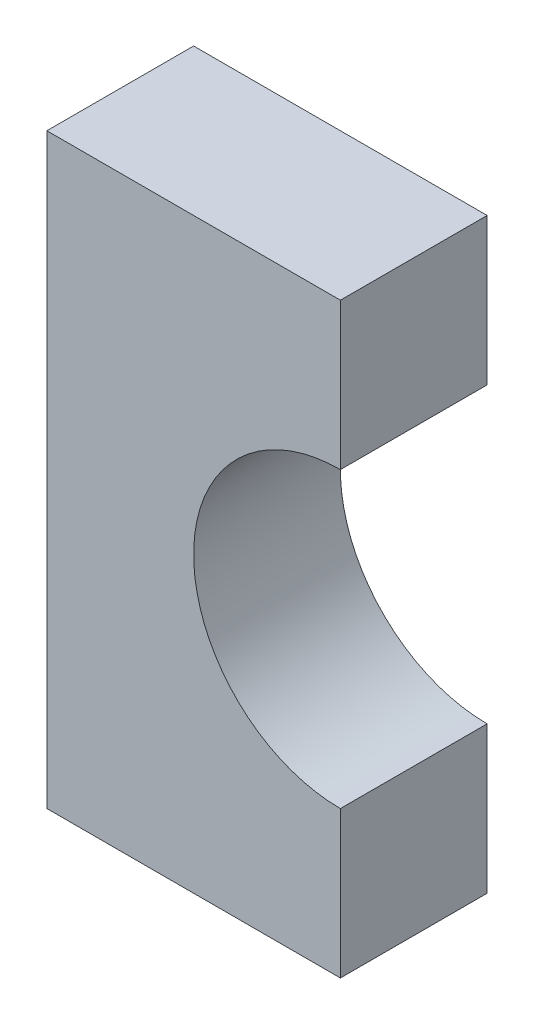
ISO-10303-21;
HEADER;
FILE_DESCRIPTION(('STEP AP214'),'2;1');
FILE_NAME('part.step','',(''),(''),'','','');
FILE_SCHEMA(('AUTOMOTIVE_DESIGN { 1 0 10303 214 1 1 1 1 }'));
ENDSEC;
DATA;
#1=APPLICATION_CONTEXT('core data for automotive mechanical design processes');
#2=APPLICATION_PROTOCOL_DEFINITION('international standard','automotive_design',2000,#1);
#3=PRODUCT_CONTEXT('',#1,'mechanical');
#4=PRODUCT('Part','Part','',(#3));
#5=PRODUCT_RELATED_PRODUCT_CATEGORY('part','',(#4));
#6=PRODUCT_DEFINITION_FORMATION('','',#4);
#7=PRODUCT_DEFINITION_CONTEXT('part definition',#1,'design');
#8=PRODUCT_DEFINITION('design','',#6,#7);
#9=PRODUCT_DEFINITION_SHAPE('','',#8);
#10=(LENGTH_UNIT() NAMED_UNIT(*) SI_UNIT(.MILLI.,.METRE.));
#11=(NAMED_UNIT(*) PLANE_ANGLE_UNIT() SI_UNIT($,.RADIAN.));
#12=(NAMED_UNIT(*) SI_UNIT($,.STERADIAN.) SOLID_ANGLE_UNIT());
#13=UNCERTAINTY_MEASURE_WITH_UNIT(LENGTH_MEASURE(1.E-05),#10,'distance_accuracy_value','');
#14=(GEOMETRIC_REPRESENTATION_CONTEXT(3) GLOBAL_UNCERTAINTY_ASSIGNED_CONTEXT((#13)) GLOBAL_UNIT_ASSIGNED_CONTEXT((#10,
#11,#12)) REPRESENTATION_CONTEXT('',''));
#15=CARTESIAN_POINT('',(0.,0.,0.));
#16=DIRECTION('',(0.,0.,1.));
#17=DIRECTION('',(1.,0.,0.));
#18=AXIS2_PLACEMENT_3D('',#15,#16,#17);
#19=CARTESIAN_POINT('',(0.4,0.4,0.));
#20=DIRECTION('',(0.,0.,1.));
#21=DIRECTION('',(1.,0.,0.));
#22=AXIS2_PLACEMENT_3D('',#19,#20,#21);
#23=PLANE('',#22);
#24=CARTESIAN_POINT('',(0.8,0.,0.));
#25=DIRECTION('',(0.,0.,-1.));
#26=DIRECTION('',(1.,0.,0.));
#27=AXIS2_PLACEMENT_3D('',#24,#25,#26);
#28=CIRCLE('',#27,0.2);
#29=CARTESIAN_POINT('',(0.8,-0.2,0.));
#30=VERTEX_POINT('',#29);
#31=CARTESIAN_POINT('',(0.8,0.2,0.));
#32=VERTEX_POINT('',#31);
#33=EDGE_CURVE('E11',#30,#32,#28,.T.);
#34=ORIENTED_EDGE('',*,*,#33,.F.);
#35=DIRECTION('',(0.,1.,0.));
#36=VECTOR('',#35,1.);
#37=CARTESIAN_POINT('',(0.8,0.4,0.));
#38=LINE('',#37,#36);
#39=CARTESIAN_POINT('',(0.8,-0.4,0.));
#40=VERTEX_POINT('',#39);
#41=EDGE_CURVE('E25',#40,#30,#38,.T.);
#42=ORIENTED_EDGE('',*,*,#41,.F.);
#43=DIRECTION('',(1.,0.,0.));
#44=VECTOR('',#43,1.);
#45=CARTESIAN_POINT('',(0.4,-0.4,0.));
#46=LINE('',#45,#44);
#47=CARTESIAN_POINT('',(0.4,-0.4,0.));
#48=VERTEX_POINT('',#47);
#49=EDGE_CURVE('E130',#48,#40,#46,.T.);
#50=ORIENTED_EDGE('',*,*,#49,.F.);
#51=DIRECTION('',(0.,-1.,0.));
#52=VECTOR('',#51,1.);
#53=CARTESIAN_POINT('',(0.4,0.4,0.));
#54=LINE('',#53,#52);
#55=CARTESIAN_POINT('',(0.4,0.4,0.));
#56=VERTEX_POINT('',#55);
#57=EDGE_CURVE('E125',#56,#48,#54,.T.);
#58=ORIENTED_EDGE('',*,*,#57,.F.);
#59=DIRECTION('',(-1.,0.,0.));
#60=VECTOR('',#59,1.);
#61=CARTESIAN_POINT('',(0.4,0.4,0.));
#62=LINE('',#61,#60);
#63=CARTESIAN_POINT('',(0.8,0.4,0.));
#64=VERTEX_POINT('',#63);
#65=EDGE_CURVE('E120',#64,#56,#62,.T.);
#66=ORIENTED_EDGE('',*,*,#65,.F.);
#67=DIRECTION('',(0.,1.,0.));
#68=VECTOR('',#67,1.);
#69=CARTESIAN_POINT('',(0.8,0.4,0.));
#70=LINE('',#69,#68);
#71=EDGE_CURVE('E115',#32,#64,#70,.T.);
#72=ORIENTED_EDGE('',*,*,#71,.F.);
#73=EDGE_LOOP('',(#34,#42,#50,#58,#66,#72));
#74=FACE_BOUND('',#73,.T.);
#75=ADVANCED_FACE('F17',(#74),#23,.F.);
#76=CARTESIAN_POINT('',(0.8,0.4,0.));
#77=DIRECTION('',(1.,0.,0.));
#78=DIRECTION('',(0.,0.,-1.));
#79=AXIS2_PLACEMENT_3D('',#76,#77,#78);
#80=PLANE('',#79);
#81=DIRECTION('',(0.,-1.,0.));
#82=VECTOR('',#81,1.);
#83=CARTESIAN_POINT('',(0.8,0.4,0.2));
#84=LINE('',#83,#82);
#85=CARTESIAN_POINT('',(0.8,0.4,0.2));
#86=VERTEX_POINT('',#85);
#87=CARTESIAN_POINT('',(0.8,0.2,0.2));
#88=VERTEX_POINT('',#87);
#89=EDGE_CURVE('E111',#86,#88,#84,.T.);
#90=ORIENTED_EDGE('',*,*,#89,.T.);
#91=DIRECTION('',(0.,0.,-1.));
#92=VECTOR('',#91,1.);
#93=CARTESIAN_POINT('',(0.8,0.2,0.));
#94=LINE('',#93,#92);
#95=EDGE_CURVE('E86',#88,#32,#94,.T.);
#96=ORIENTED_EDGE('',*,*,#95,.T.);
#97=ORIENTED_EDGE('',*,*,#71,.T.);
#98=DIRECTION('',(0.,0.,1.));
#99=VECTOR('',#98,1.);
#100=CARTESIAN_POINT('',(0.8,0.4,0.));
#101=LINE('',#100,#99);
#102=EDGE_CURVE('E104',#64,#86,#101,.T.);
#103=ORIENTED_EDGE('',*,*,#102,.T.);
#104=EDGE_LOOP('',(#90,#96,#97,#103));
#105=FACE_BOUND('',#104,.T.);
#106=ADVANCED_FACE('F150',(#105),#80,.T.);
#107=CARTESIAN_POINT('',(0.4,0.4,0.));
#108=DIRECTION('',(0.,1.,0.));
#109=DIRECTION('',(0.,0.,1.));
#110=AXIS2_PLACEMENT_3D('',#107,#108,#109);
#111=PLANE('',#110);
#112=ORIENTED_EDGE('',*,*,#102,.F.);
#113=ORIENTED_EDGE('',*,*,#65,.T.);
#114=DIRECTION('',(0.,0.,-1.));
#115=VECTOR('',#114,1.);
#116=CARTESIAN_POINT('',(0.4,0.4,0.));
#117=LINE('',#116,#115);
#118=CARTESIAN_POINT('',(0.4,0.4,0.2));
#119=VERTEX_POINT('',#118);
#120=EDGE_CURVE('E91',#119,#56,#117,.T.);
#121=ORIENTED_EDGE('',*,*,#120,.F.);
#122=DIRECTION('',(1.,0.,0.));
#123=VECTOR('',#122,1.);
#124=CARTESIAN_POINT('',(0.4,0.4,0.2));
#125=LINE('',#124,#123);
#126=EDGE_CURVE('E87',#119,#86,#125,.T.);
#127=ORIENTED_EDGE('',*,*,#126,.T.);
#128=EDGE_LOOP('',(#112,#113,#121,#127));
#129=FACE_BOUND('',#128,.T.);
#130=ADVANCED_FACE('F148',(#129),#111,.T.);
#131=CARTESIAN_POINT('',(0.4,0.4,0.2));
#132=DIRECTION('',(0.,0.,1.));
#133=DIRECTION('',(1.,0.,0.));
#134=AXIS2_PLACEMENT_3D('',#131,#132,#133);
#135=PLANE('',#134);
#136=CARTESIAN_POINT('',(0.8,0.,0.2));
#137=DIRECTION('',(0.,0.,-1.));
#138=DIRECTION('',(1.,0.,0.));
#139=AXIS2_PLACEMENT_3D('',#136,#137,#138);
#140=CIRCLE('',#139,0.2);
#141=CARTESIAN_POINT('',(0.8,-0.2,0.2));
#142=VERTEX_POINT('',#141);
#143=EDGE_CURVE('E71',#142,#88,#140,.T.);
#144=ORIENTED_EDGE('',*,*,#143,.T.);
#145=ORIENTED_EDGE('',*,*,#89,.F.);
#146=ORIENTED_EDGE('',*,*,#126,.F.);
#147=DIRECTION('',(0.,1.,0.));
#148=VECTOR('',#147,1.);
#149=CARTESIAN_POINT('',(0.4,-0.4,0.2));
#150=LINE('',#149,#148);
#151=CARTESIAN_POINT('',(0.4,-0.4,0.2));
#152=VERTEX_POINT('',#151);
#153=EDGE_CURVE('E88',#152,#119,#150,.T.);
#154=ORIENTED_EDGE('',*,*,#153,.F.);
#155=DIRECTION('',(-1.,0.,0.));
#156=VECTOR('',#155,1.);
#157=CARTESIAN_POINT('',(0.8,-0.4,0.2));
#158=LINE('',#157,#156);
#159=CARTESIAN_POINT('',(0.8,-0.4,0.2));
#160=VERTEX_POINT('',#159);
#161=EDGE_CURVE('E74',#160,#152,#158,.T.);
#162=ORIENTED_EDGE('',*,*,#161,.F.);
#163=DIRECTION('',(0.,-1.,0.));
#164=VECTOR('',#163,1.);
#165=CARTESIAN_POINT('',(0.8,0.4,0.2));
#166=LINE('',#165,#164);
#167=EDGE_CURVE('E66',#142,#160,#166,.T.);
#168=ORIENTED_EDGE('',*,*,#167,.F.);
#169=EDGE_LOOP('',(#144,#145,#146,#154,#162,#168));
#170=FACE_BOUND('',#169,.T.);
#171=ADVANCED_FACE('F68',(#170),#135,.T.);
#172=CARTESIAN_POINT('',(0.8,0.4,0.));
#173=DIRECTION('',(1.,0.,0.));
#174=DIRECTION('',(0.,0.,-1.));
#175=AXIS2_PLACEMENT_3D('',#172,#173,#174);
#176=PLANE('',#175);
#177=ORIENTED_EDGE('',*,*,#167,.T.);
#178=DIRECTION('',(0.,0.,-1.));
#179=VECTOR('',#178,1.);
#180=CARTESIAN_POINT('',(0.8,-0.4,0.));
#181=LINE('',#180,#179);
#182=EDGE_CURVE('E77',#160,#40,#181,.T.);
#183=ORIENTED_EDGE('',*,*,#182,.T.);
#184=ORIENTED_EDGE('',*,*,#41,.T.);
#185=DIRECTION('',(0.,0.,1.));
#186=VECTOR('',#185,1.);
#187=CARTESIAN_POINT('',(0.8,-0.2,0.2));
#188=LINE('',#187,#186);
#189=EDGE_CURVE('E79',#30,#142,#188,.T.);
#190=ORIENTED_EDGE('',*,*,#189,.T.);
#191=EDGE_LOOP('',(#177,#183,#184,#190));
#192=FACE_BOUND('',#191,.T.);
#193=ADVANCED_FACE('F80',(#192),#176,.T.);
#194=CARTESIAN_POINT('',(0.8,0.,0.2));
#195=DIRECTION('',(0.,0.,1.));
#196=DIRECTION('',(1.,0.,0.));
#197=AXIS2_PLACEMENT_3D('',#194,#195,#196);
#198=CYLINDRICAL_SURFACE('',#197,0.2);
#199=ORIENTED_EDGE('',*,*,#33,.T.);
#200=ORIENTED_EDGE('',*,*,#95,.F.);
#201=ORIENTED_EDGE('',*,*,#143,.F.);
#202=ORIENTED_EDGE('',*,*,#189,.F.);
#203=EDGE_LOOP('',(#199,#200,#201,#202));
#204=FACE_BOUND('',#203,.T.);
#205=ADVANCED_FACE('F84',(#204),#198,.F.);
#206=CARTESIAN_POINT('',(0.8,-0.4,0.));
#207=DIRECTION('',(0.,-1.,0.));
#208=DIRECTION('',(0.,0.,-1.));
#209=AXIS2_PLACEMENT_3D('',#206,#207,#208);
#210=PLANE('',#209);
#211=DIRECTION('',(0.,0.,-1.));
#212=VECTOR('',#211,1.);
#213=CARTESIAN_POINT('',(0.4,-0.4,0.));
#214=LINE('',#213,#212);
#215=EDGE_CURVE('E82',#152,#48,#214,.T.);
#216=ORIENTED_EDGE('',*,*,#215,.T.);
#217=ORIENTED_EDGE('',*,*,#49,.T.);
#218=ORIENTED_EDGE('',*,*,#182,.F.);
#219=ORIENTED_EDGE('',*,*,#161,.T.);
#220=EDGE_LOOP('',(#216,#217,#218,#219));
#221=FACE_BOUND('',#220,.T.);
#222=ADVANCED_FACE('F141',(#221),#210,.T.);
#223=CARTESIAN_POINT('',(0.4,-0.4,0.));
#224=DIRECTION('',(-1.,0.,0.));
#225=DIRECTION('',(0.,0.,1.));
#226=AXIS2_PLACEMENT_3D('',#223,#224,#225);
#227=PLANE('',#226);
#228=ORIENTED_EDGE('',*,*,#120,.T.);
#229=ORIENTED_EDGE('',*,*,#57,.T.);
#230=ORIENTED_EDGE('',*,*,#215,.F.);
#231=ORIENTED_EDGE('',*,*,#153,.T.);
#232=EDGE_LOOP('',(#228,#229,#230,#231));
#233=FACE_BOUND('',#232,.T.);
#234=ADVANCED_FACE('F145',(#233),#227,.T.);
#235=CLOSED_SHELL('',(#75,#106,#130,#171,#193,#205,#222,#234));
#236=MANIFOLD_SOLID_BREP('B1',#235);
#237=ADVANCED_BREP_SHAPE_REPRESENTATION('',(#18,#236),#14);
#238=SHAPE_DEFINITION_REPRESENTATION(#9,#237);
ENDSEC;
END-ISO-10303-21;
